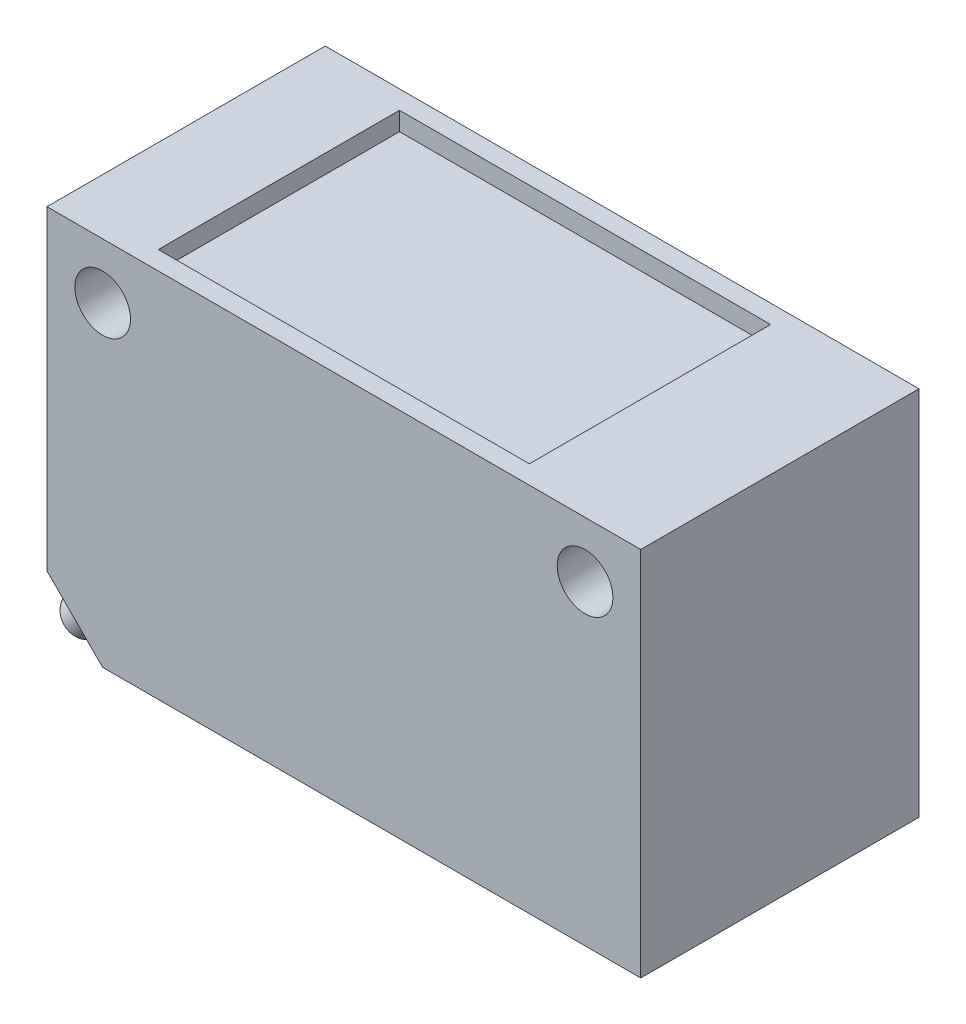
ISO-10303-21;
HEADER;
FILE_DESCRIPTION(('STEP AP214'),'2;1');
FILE_NAME('part.step','',(''),(''),'','','');
FILE_SCHEMA(('AUTOMOTIVE_DESIGN { 1 0 10303 214 1 1 1 1 }'));
ENDSEC;
DATA;
#1=APPLICATION_CONTEXT('core data for automotive mechanical design processes');
#2=APPLICATION_PROTOCOL_DEFINITION('international standard','automotive_design',2000,#1);
#3=PRODUCT_CONTEXT('',#1,'mechanical');
#4=PRODUCT('Part','Part','',(#3));
#5=PRODUCT_RELATED_PRODUCT_CATEGORY('part','',(#4));
#6=PRODUCT_DEFINITION_FORMATION('','',#4);
#7=PRODUCT_DEFINITION_CONTEXT('part definition',#1,'design');
#8=PRODUCT_DEFINITION('design','',#6,#7);
#9=PRODUCT_DEFINITION_SHAPE('','',#8);
#10=(LENGTH_UNIT() NAMED_UNIT(*) SI_UNIT(.MILLI.,.METRE.));
#11=(NAMED_UNIT(*) PLANE_ANGLE_UNIT() SI_UNIT($,.RADIAN.));
#12=(NAMED_UNIT(*) SI_UNIT($,.STERADIAN.) SOLID_ANGLE_UNIT());
#13=UNCERTAINTY_MEASURE_WITH_UNIT(LENGTH_MEASURE(1.E-05),#10,'distance_accuracy_value','');
#14=(GEOMETRIC_REPRESENTATION_CONTEXT(3) GLOBAL_UNCERTAINTY_ASSIGNED_CONTEXT((#13)) GLOBAL_UNIT_ASSIGNED_CONTEXT((#10,
#11,#12)) REPRESENTATION_CONTEXT('',''));
#15=CARTESIAN_POINT('',(0.,0.,0.));
#16=DIRECTION('',(0.,0.,1.));
#17=DIRECTION('',(1.,0.,0.));
#18=AXIS2_PLACEMENT_3D('',#15,#16,#17);
#19=CARTESIAN_POINT('',(-13.,-10.,15.));
#20=DIRECTION('',(0.707106781186548,0.707106781186547,0.));
#21=DIRECTION('',(0.,0.,-1.));
#22=AXIS2_PLACEMENT_3D('',#19,#20,#21);
#23=PLANE('',#22);
#24=DIRECTION('',(-0.707106781186547,0.707106781186548,0.));
#25=VECTOR('',#24,1.);
#26=CARTESIAN_POINT('',(-11.5,-11.5,15.));
#27=LINE('',#26,#25);
#28=CARTESIAN_POINT('',(-16.,-6.99999999999998,15.));
#29=VERTEX_POINT('',#28);
#30=CARTESIAN_POINT('',(-13.,-10.,15.));
#31=VERTEX_POINT('',#30);
#32=EDGE_CURVE('E11',#29,#31,#27,.F.);
#33=ORIENTED_EDGE('',*,*,#32,.F.);
#34=DIRECTION('',(0.,0.,1.));
#35=VECTOR('',#34,1.);
#36=CARTESIAN_POINT('',(-16.,-6.99999999999999,15.));
#37=LINE('',#36,#35);
#38=CARTESIAN_POINT('',(-16.,-6.99999999999999,0.));
#39=VERTEX_POINT('',#38);
#40=EDGE_CURVE('E42',#39,#29,#37,.T.);
#41=ORIENTED_EDGE('',*,*,#40,.F.);
#42=DIRECTION('',(0.707106781186547,-0.707106781186548,0.));
#43=VECTOR('',#42,1.);
#44=CARTESIAN_POINT('',(-13.,-10.,0.));
#45=LINE('',#44,#43);
#46=CARTESIAN_POINT('',(-13.,-10.,0.));
#47=VERTEX_POINT('',#46);
#48=EDGE_CURVE('E189',#47,#39,#45,.F.);
#49=ORIENTED_EDGE('',*,*,#48,.F.);
#50=DIRECTION('',(0.,0.,-1.));
#51=VECTOR('',#50,1.);
#52=CARTESIAN_POINT('',(-13.,-10.,15.));
#53=LINE('',#52,#51);
#54=EDGE_CURVE('E186',#31,#47,#53,.T.);
#55=ORIENTED_EDGE('',*,*,#54,.F.);
#56=EDGE_LOOP('',(#33,#41,#49,#55));
#57=FACE_BOUND('',#56,.T.);
#58=CARTESIAN_POINT('',(-14.4990663761155,-8.50093362388452,7.5));
#59=DIRECTION('',(-0.707106781186549,-0.707106781186546,0.));
#60=DIRECTION('',(0.707106781186546,-0.707106781186549,0.));
#61=AXIS2_PLACEMENT_3D('',#58,#59,#60);
#62=CIRCLE('',#61,1.);
#63=CARTESIAN_POINT('',(-13.7919595949289,-9.20804040507107,7.5));
#64=VERTEX_POINT('',#63);
#65=EDGE_CURVE('E140',#64,#64,#62,.T.);
#66=ORIENTED_EDGE('',*,*,#65,.F.);
#67=EDGE_LOOP('',(#66));
#68=FACE_BOUND('',#67,.T.);
#69=ADVANCED_FACE('F35',(#57,#68),#23,.F.);
#70=CARTESIAN_POINT('',(0.,0.,15.));
#71=DIRECTION('',(0.,0.,1.));
#72=DIRECTION('',(1.,0.,0.));
#73=AXIS2_PLACEMENT_3D('',#70,#71,#72);
#74=PLANE('',#73);
#75=DIRECTION('',(0.,-1.,0.));
#76=VECTOR('',#75,1.);
#77=CARTESIAN_POINT('',(-16.,10.,15.));
#78=LINE('',#77,#76);
#79=CARTESIAN_POINT('',(-16.,10.,15.));
#80=VERTEX_POINT('',#79);
#81=EDGE_CURVE('E162',#80,#29,#78,.T.);
#82=ORIENTED_EDGE('',*,*,#81,.T.);
#83=ORIENTED_EDGE('',*,*,#32,.T.);
#84=DIRECTION('',(1.,0.,0.));
#85=VECTOR('',#84,1.);
#86=CARTESIAN_POINT('',(-16.,-10.,15.));
#87=LINE('',#86,#85);
#88=CARTESIAN_POINT('',(16.,-10.,15.));
#89=VERTEX_POINT('',#88);
#90=EDGE_CURVE('E164',#31,#89,#87,.T.);
#91=ORIENTED_EDGE('',*,*,#90,.T.);
#92=DIRECTION('',(0.,1.,0.));
#93=VECTOR('',#92,1.);
#94=CARTESIAN_POINT('',(16.,10.,15.));
#95=LINE('',#94,#93);
#96=CARTESIAN_POINT('',(16.,10.,15.));
#97=VERTEX_POINT('',#96);
#98=EDGE_CURVE('E167',#89,#97,#95,.T.);
#99=ORIENTED_EDGE('',*,*,#98,.T.);
#100=DIRECTION('',(-1.,0.,0.));
#101=VECTOR('',#100,1.);
#102=CARTESIAN_POINT('',(-16.,10.,15.));
#103=LINE('',#102,#101);
#104=EDGE_CURVE('E169',#97,#80,#103,.T.);
#105=ORIENTED_EDGE('',*,*,#104,.T.);
#106=EDGE_LOOP('',(#82,#83,#91,#99,#105));
#107=FACE_BOUND('',#106,.T.);
#108=CARTESIAN_POINT('',(-13.,7.,15.));
#109=DIRECTION('',(0.,0.,1.));
#110=DIRECTION('',(1.,0.,0.));
#111=AXIS2_PLACEMENT_3D('',#108,#109,#110);
#112=CIRCLE('',#111,1.5);
#113=CARTESIAN_POINT('',(-11.5,7.,15.));
#114=VERTEX_POINT('',#113);
#115=EDGE_CURVE('E153',#114,#114,#112,.T.);
#116=ORIENTED_EDGE('',*,*,#115,.F.);
#117=EDGE_LOOP('',(#116));
#118=FACE_BOUND('',#117,.T.);
#119=CARTESIAN_POINT('',(13.,7.,15.));
#120=DIRECTION('',(0.,0.,-1.));
#121=DIRECTION('',(-1.,0.,0.));
#122=AXIS2_PLACEMENT_3D('',#119,#120,#121);
#123=CIRCLE('',#122,1.5);
#124=CARTESIAN_POINT('',(11.5,7.,15.));
#125=VERTEX_POINT('',#124);
#126=EDGE_CURVE('E147',#125,#125,#123,.T.);
#127=ORIENTED_EDGE('',*,*,#126,.T.);
#128=EDGE_LOOP('',(#127));
#129=FACE_BOUND('',#128,.T.);
#130=ADVANCED_FACE('F205',(#107,#118,#129),#74,.T.);
#131=CARTESIAN_POINT('',(0.,0.,0.));
#132=DIRECTION('',(0.,0.,1.));
#133=DIRECTION('',(1.,0.,0.));
#134=AXIS2_PLACEMENT_3D('',#131,#132,#133);
#135=PLANE('',#134);
#136=DIRECTION('',(1.,0.,0.));
#137=VECTOR('',#136,1.);
#138=CARTESIAN_POINT('',(-16.,-10.,0.));
#139=LINE('',#138,#137);
#140=CARTESIAN_POINT('',(16.,-10.,0.));
#141=VERTEX_POINT('',#140);
#142=EDGE_CURVE('E173',#47,#141,#139,.T.);
#143=ORIENTED_EDGE('',*,*,#142,.F.);
#144=ORIENTED_EDGE('',*,*,#48,.T.);
#145=DIRECTION('',(0.,-1.,0.));
#146=VECTOR('',#145,1.);
#147=CARTESIAN_POINT('',(-16.,10.,0.));
#148=LINE('',#147,#146);
#149=CARTESIAN_POINT('',(-16.,10.,0.));
#150=VERTEX_POINT('',#149);
#151=EDGE_CURVE('E159',#150,#39,#148,.T.);
#152=ORIENTED_EDGE('',*,*,#151,.F.);
#153=DIRECTION('',(-1.,0.,0.));
#154=VECTOR('',#153,1.);
#155=CARTESIAN_POINT('',(-16.,10.,0.));
#156=LINE('',#155,#154);
#157=CARTESIAN_POINT('',(16.,10.,0.));
#158=VERTEX_POINT('',#157);
#159=EDGE_CURVE('E165',#158,#150,#156,.T.);
#160=ORIENTED_EDGE('',*,*,#159,.F.);
#161=DIRECTION('',(0.,1.,0.));
#162=VECTOR('',#161,1.);
#163=CARTESIAN_POINT('',(16.,10.,0.));
#164=LINE('',#163,#162);
#165=EDGE_CURVE('E175',#141,#158,#164,.T.);
#166=ORIENTED_EDGE('',*,*,#165,.F.);
#167=EDGE_LOOP('',(#143,#144,#152,#160,#166));
#168=FACE_BOUND('',#167,.T.);
#169=CARTESIAN_POINT('',(-13.,7.,0.));
#170=DIRECTION('',(0.,0.,1.));
#171=DIRECTION('',(1.,0.,0.));
#172=AXIS2_PLACEMENT_3D('',#169,#170,#171);
#173=CIRCLE('',#172,1.5);
#174=CARTESIAN_POINT('',(-11.5,7.,0.));
#175=VERTEX_POINT('',#174);
#176=EDGE_CURVE('E156',#175,#175,#173,.T.);
#177=ORIENTED_EDGE('',*,*,#176,.T.);
#178=EDGE_LOOP('',(#177));
#179=FACE_BOUND('',#178,.T.);
#180=CARTESIAN_POINT('',(13.,7.,0.));
#181=DIRECTION('',(0.,0.,-1.));
#182=DIRECTION('',(-1.,0.,0.));
#183=AXIS2_PLACEMENT_3D('',#180,#181,#182);
#184=CIRCLE('',#183,1.5);
#185=CARTESIAN_POINT('',(11.5,7.,0.));
#186=VERTEX_POINT('',#185);
#187=EDGE_CURVE('E150',#186,#186,#184,.T.);
#188=ORIENTED_EDGE('',*,*,#187,.F.);
#189=EDGE_LOOP('',(#188));
#190=FACE_BOUND('',#189,.T.);
#191=ADVANCED_FACE('F193',(#168,#179,#190),#135,.F.);
#192=CARTESIAN_POINT('',(-16.,10.,15.));
#193=DIRECTION('',(1.,0.,0.));
#194=DIRECTION('',(0.,1.,0.));
#195=AXIS2_PLACEMENT_3D('',#192,#193,#194);
#196=PLANE('',#195);
#197=ORIENTED_EDGE('',*,*,#151,.T.);
#198=ORIENTED_EDGE('',*,*,#40,.T.);
#199=ORIENTED_EDGE('',*,*,#81,.F.);
#200=DIRECTION('',(0.,0.,-1.));
#201=VECTOR('',#200,1.);
#202=CARTESIAN_POINT('',(-16.,10.,15.));
#203=LINE('',#202,#201);
#204=EDGE_CURVE('E171',#80,#150,#203,.T.);
#205=ORIENTED_EDGE('',*,*,#204,.T.);
#206=EDGE_LOOP('',(#197,#198,#199,#205));
#207=FACE_BOUND('',#206,.T.);
#208=ADVANCED_FACE('F199',(#207),#196,.F.);
#209=CARTESIAN_POINT('',(-16.,-10.,15.));
#210=DIRECTION('',(0.,1.,0.));
#211=DIRECTION('',(0.,0.,1.));
#212=AXIS2_PLACEMENT_3D('',#209,#210,#211);
#213=PLANE('',#212);
#214=ORIENTED_EDGE('',*,*,#90,.F.);
#215=ORIENTED_EDGE('',*,*,#54,.T.);
#216=ORIENTED_EDGE('',*,*,#142,.T.);
#217=DIRECTION('',(0.,0.,-1.));
#218=VECTOR('',#217,1.);
#219=CARTESIAN_POINT('',(16.,-10.,15.));
#220=LINE('',#219,#218);
#221=EDGE_CURVE('E183',#89,#141,#220,.T.);
#222=ORIENTED_EDGE('',*,*,#221,.F.);
#223=EDGE_LOOP('',(#214,#215,#216,#222));
#224=FACE_BOUND('',#223,.T.);
#225=ADVANCED_FACE('F209',(#224),#213,.F.);
#226=CARTESIAN_POINT('',(16.,10.,15.));
#227=DIRECTION('',(-1.,0.,0.));
#228=DIRECTION('',(0.,0.,1.));
#229=AXIS2_PLACEMENT_3D('',#226,#227,#228);
#230=PLANE('',#229);
#231=ORIENTED_EDGE('',*,*,#165,.T.);
#232=DIRECTION('',(0.,0.,-1.));
#233=VECTOR('',#232,1.);
#234=CARTESIAN_POINT('',(16.,10.,15.));
#235=LINE('',#234,#233);
#236=EDGE_CURVE('E180',#97,#158,#235,.T.);
#237=ORIENTED_EDGE('',*,*,#236,.F.);
#238=ORIENTED_EDGE('',*,*,#98,.F.);
#239=ORIENTED_EDGE('',*,*,#221,.T.);
#240=EDGE_LOOP('',(#231,#237,#238,#239));
#241=FACE_BOUND('',#240,.T.);
#242=ADVANCED_FACE('F213',(#241),#230,.F.);
#243=CARTESIAN_POINT('',(-16.,10.,15.));
#244=DIRECTION('',(0.,-1.,0.));
#245=DIRECTION('',(0.,0.,-1.));
#246=AXIS2_PLACEMENT_3D('',#243,#244,#245);
#247=PLANE('',#246);
#248=DIRECTION('',(-1.,0.,0.));
#249=VECTOR('',#248,1.);
#250=CARTESIAN_POINT('',(9.,10.,1.));
#251=LINE('',#250,#249);
#252=CARTESIAN_POINT('',(9.,10.,1.));
#253=VERTEX_POINT('',#252);
#254=CARTESIAN_POINT('',(-11.,10.,1.));
#255=VERTEX_POINT('',#254);
#256=EDGE_CURVE('E134',#253,#255,#251,.T.);
#257=ORIENTED_EDGE('',*,*,#256,.F.);
#258=DIRECTION('',(0.,0.,-1.));
#259=VECTOR('',#258,1.);
#260=CARTESIAN_POINT('',(9.,10.,14.));
#261=LINE('',#260,#259);
#262=CARTESIAN_POINT('',(9.,10.,14.));
#263=VERTEX_POINT('',#262);
#264=EDGE_CURVE('E49',#263,#253,#261,.T.);
#265=ORIENTED_EDGE('',*,*,#264,.F.);
#266=DIRECTION('',(1.,0.,0.));
#267=VECTOR('',#266,1.);
#268=CARTESIAN_POINT('',(9.,10.,14.));
#269=LINE('',#268,#267);
#270=CARTESIAN_POINT('',(-11.,10.,14.));
#271=VERTEX_POINT('',#270);
#272=EDGE_CURVE('E125',#271,#263,#269,.T.);
#273=ORIENTED_EDGE('',*,*,#272,.F.);
#274=DIRECTION('',(0.,0.,1.));
#275=VECTOR('',#274,1.);
#276=CARTESIAN_POINT('',(-11.,10.,14.));
#277=LINE('',#276,#275);
#278=EDGE_CURVE('E128',#255,#271,#277,.T.);
#279=ORIENTED_EDGE('',*,*,#278,.F.);
#280=EDGE_LOOP('',(#257,#265,#273,#279));
#281=FACE_BOUND('',#280,.T.);
#282=ORIENTED_EDGE('',*,*,#159,.T.);
#283=ORIENTED_EDGE('',*,*,#204,.F.);
#284=ORIENTED_EDGE('',*,*,#104,.F.);
#285=ORIENTED_EDGE('',*,*,#236,.T.);
#286=EDGE_LOOP('',(#282,#283,#284,#285));
#287=FACE_BOUND('',#286,.T.);
#288=ADVANCED_FACE('F216',(#281,#287),#247,.F.);
#289=CARTESIAN_POINT('',(-13.,7.,0.));
#290=DIRECTION('',(0.,0.,1.));
#291=DIRECTION('',(1.,0.,0.));
#292=AXIS2_PLACEMENT_3D('',#289,#290,#291);
#293=CYLINDRICAL_SURFACE('',#292,1.5);
#294=ORIENTED_EDGE('',*,*,#176,.F.);
#295=EDGE_LOOP('',(#294));
#296=FACE_BOUND('',#295,.T.);
#297=ORIENTED_EDGE('',*,*,#115,.T.);
#298=EDGE_LOOP('',(#297));
#299=FACE_BOUND('',#298,.T.);
#300=ADVANCED_FACE('F218',(#296,#299),#293,.F.);
#301=CARTESIAN_POINT('',(13.,7.,0.));
#302=DIRECTION('',(0.,0.,1.));
#303=DIRECTION('',(1.,0.,0.));
#304=AXIS2_PLACEMENT_3D('',#301,#302,#303);
#305=CYLINDRICAL_SURFACE('',#304,1.5);
#306=ORIENTED_EDGE('',*,*,#187,.T.);
#307=EDGE_LOOP('',(#306));
#308=FACE_BOUND('',#307,.T.);
#309=ORIENTED_EDGE('',*,*,#126,.F.);
#310=EDGE_LOOP('',(#309));
#311=FACE_BOUND('',#310,.T.);
#312=ADVANCED_FACE('F225',(#308,#311),#305,.F.);
#313=CARTESIAN_POINT('',(-21.570134187981,-15.57200143575,7.5));
#314=DIRECTION('',(0.707106781186549,0.707106781186546,0.));
#315=DIRECTION('',(-0.707106781186546,0.707106781186549,0.));
#316=AXIS2_PLACEMENT_3D('',#313,#314,#315);
#317=CYLINDRICAL_SURFACE('',#316,1.);
#318=CARTESIAN_POINT('',(-21.570134187981,-15.57200143575,7.5));
#319=DIRECTION('',(-0.707106781186549,-0.707106781186546,0.));
#320=DIRECTION('',(0.707106781186546,-0.707106781186549,0.));
#321=AXIS2_PLACEMENT_3D('',#318,#319,#320);
#322=CIRCLE('',#321,1.);
#323=CARTESIAN_POINT('',(-20.8630274067944,-16.2791082169365,7.5));
#324=VERTEX_POINT('',#323);
#325=EDGE_CURVE('E144',#324,#324,#322,.T.);
#326=ORIENTED_EDGE('',*,*,#325,.F.);
#327=EDGE_LOOP('',(#326));
#328=FACE_BOUND('',#327,.T.);
#329=ORIENTED_EDGE('',*,*,#65,.T.);
#330=EDGE_LOOP('',(#329));
#331=FACE_BOUND('',#330,.T.);
#332=ADVANCED_FACE('F241',(#328,#331),#317,.T.);
#333=CARTESIAN_POINT('',(-21.570134187981,-15.57200143575,7.5));
#334=DIRECTION('',(-0.707106781186549,-0.707106781186546,0.));
#335=DIRECTION('',(0.707106781186546,-0.707106781186549,0.));
#336=AXIS2_PLACEMENT_3D('',#333,#334,#335);
#337=PLANE('',#336);
#338=ORIENTED_EDGE('',*,*,#325,.T.);
#339=EDGE_LOOP('',(#338));
#340=FACE_BOUND('',#339,.T.);
#341=ADVANCED_FACE('F245',(#340),#337,.T.);
#342=CARTESIAN_POINT('',(9.,9.,14.));
#343=DIRECTION('',(1.,0.,0.));
#344=DIRECTION('',(0.,0.,-1.));
#345=AXIS2_PLACEMENT_3D('',#342,#343,#344);
#346=PLANE('',#345);
#347=ORIENTED_EDGE('',*,*,#264,.T.);
#348=DIRECTION('',(0.,1.,0.));
#349=VECTOR('',#348,1.);
#350=CARTESIAN_POINT('',(9.,9.,1.));
#351=LINE('',#350,#349);
#352=CARTESIAN_POINT('',(9.,9.,1.));
#353=VERTEX_POINT('',#352);
#354=EDGE_CURVE('E103',#353,#253,#351,.T.);
#355=ORIENTED_EDGE('',*,*,#354,.F.);
#356=DIRECTION('',(0.,0.,-1.));
#357=VECTOR('',#356,1.);
#358=CARTESIAN_POINT('',(9.,9.,14.));
#359=LINE('',#358,#357);
#360=CARTESIAN_POINT('',(9.,9.,14.));
#361=VERTEX_POINT('',#360);
#362=EDGE_CURVE('E107',#361,#353,#359,.T.);
#363=ORIENTED_EDGE('',*,*,#362,.F.);
#364=DIRECTION('',(0.,1.,0.));
#365=VECTOR('',#364,1.);
#366=CARTESIAN_POINT('',(9.,9.,14.));
#367=LINE('',#366,#365);
#368=EDGE_CURVE('E138',#361,#263,#367,.T.);
#369=ORIENTED_EDGE('',*,*,#368,.T.);
#370=EDGE_LOOP('',(#347,#355,#363,#369));
#371=FACE_BOUND('',#370,.T.);
#372=ADVANCED_FACE('F105',(#371),#346,.F.);
#373=CARTESIAN_POINT('',(9.,9.,14.));
#374=DIRECTION('',(0.,0.,1.));
#375=DIRECTION('',(1.,0.,0.));
#376=AXIS2_PLACEMENT_3D('',#373,#374,#375);
#377=PLANE('',#376);
#378=ORIENTED_EDGE('',*,*,#272,.T.);
#379=ORIENTED_EDGE('',*,*,#368,.F.);
#380=DIRECTION('',(1.,0.,0.));
#381=VECTOR('',#380,1.);
#382=CARTESIAN_POINT('',(9.,9.,14.));
#383=LINE('',#382,#381);
#384=CARTESIAN_POINT('',(-11.,9.,14.));
#385=VERTEX_POINT('',#384);
#386=EDGE_CURVE('E113',#385,#361,#383,.T.);
#387=ORIENTED_EDGE('',*,*,#386,.F.);
#388=DIRECTION('',(0.,1.,0.));
#389=VECTOR('',#388,1.);
#390=CARTESIAN_POINT('',(-11.,9.,14.));
#391=LINE('',#390,#389);
#392=EDGE_CURVE('E141',#385,#271,#391,.T.);
#393=ORIENTED_EDGE('',*,*,#392,.T.);
#394=EDGE_LOOP('',(#378,#379,#387,#393));
#395=FACE_BOUND('',#394,.T.);
#396=ADVANCED_FACE('F252',(#395),#377,.F.);
#397=CARTESIAN_POINT('',(-11.,9.,14.));
#398=DIRECTION('',(-1.,0.,0.));
#399=DIRECTION('',(0.,0.,1.));
#400=AXIS2_PLACEMENT_3D('',#397,#398,#399);
#401=PLANE('',#400);
#402=ORIENTED_EDGE('',*,*,#278,.T.);
#403=ORIENTED_EDGE('',*,*,#392,.F.);
#404=DIRECTION('',(0.,0.,1.));
#405=VECTOR('',#404,1.);
#406=CARTESIAN_POINT('',(-11.,9.,14.));
#407=LINE('',#406,#405);
#408=CARTESIAN_POINT('',(-11.,9.,1.));
#409=VERTEX_POINT('',#408);
#410=EDGE_CURVE('E121',#409,#385,#407,.T.);
#411=ORIENTED_EDGE('',*,*,#410,.F.);
#412=DIRECTION('',(0.,1.,0.));
#413=VECTOR('',#412,1.);
#414=CARTESIAN_POINT('',(-11.,9.,1.));
#415=LINE('',#414,#413);
#416=EDGE_CURVE('E112',#409,#255,#415,.T.);
#417=ORIENTED_EDGE('',*,*,#416,.T.);
#418=EDGE_LOOP('',(#402,#403,#411,#417));
#419=FACE_BOUND('',#418,.T.);
#420=ADVANCED_FACE('F255',(#419),#401,.F.);
#421=CARTESIAN_POINT('',(9.,9.,1.));
#422=DIRECTION('',(0.,0.,-1.));
#423=DIRECTION('',(-1.,0.,0.));
#424=AXIS2_PLACEMENT_3D('',#421,#422,#423);
#425=PLANE('',#424);
#426=ORIENTED_EDGE('',*,*,#256,.T.);
#427=ORIENTED_EDGE('',*,*,#416,.F.);
#428=DIRECTION('',(-1.,0.,0.));
#429=VECTOR('',#428,1.);
#430=CARTESIAN_POINT('',(9.,9.,1.));
#431=LINE('',#430,#429);
#432=EDGE_CURVE('E116',#353,#409,#431,.T.);
#433=ORIENTED_EDGE('',*,*,#432,.F.);
#434=ORIENTED_EDGE('',*,*,#354,.T.);
#435=EDGE_LOOP('',(#426,#427,#433,#434));
#436=FACE_BOUND('',#435,.T.);
#437=ADVANCED_FACE('F117',(#436),#425,.F.);
#438=CARTESIAN_POINT('',(0.,9.,0.));
#439=DIRECTION('',(0.,1.,0.));
#440=DIRECTION('',(0.,0.,1.));
#441=AXIS2_PLACEMENT_3D('',#438,#439,#440);
#442=PLANE('',#441);
#443=ORIENTED_EDGE('',*,*,#362,.T.);
#444=ORIENTED_EDGE('',*,*,#432,.T.);
#445=ORIENTED_EDGE('',*,*,#410,.T.);
#446=ORIENTED_EDGE('',*,*,#386,.T.);
#447=EDGE_LOOP('',(#443,#444,#445,#446));
#448=FACE_BOUND('',#447,.T.);
#449=ADVANCED_FACE('F123',(#448),#442,.T.);
#450=CLOSED_SHELL('',(#69,#130,#191,#208,#225,#242,#288,#300,#312,#332,#341,#372,#396,#420,#437,#449));
#451=MANIFOLD_SOLID_BREP('B2',#450);
#452=ADVANCED_BREP_SHAPE_REPRESENTATION('',(#18,#451),#14);
#453=SHAPE_DEFINITION_REPRESENTATION(#9,#452);
ENDSEC;
END-ISO-10303-21;
